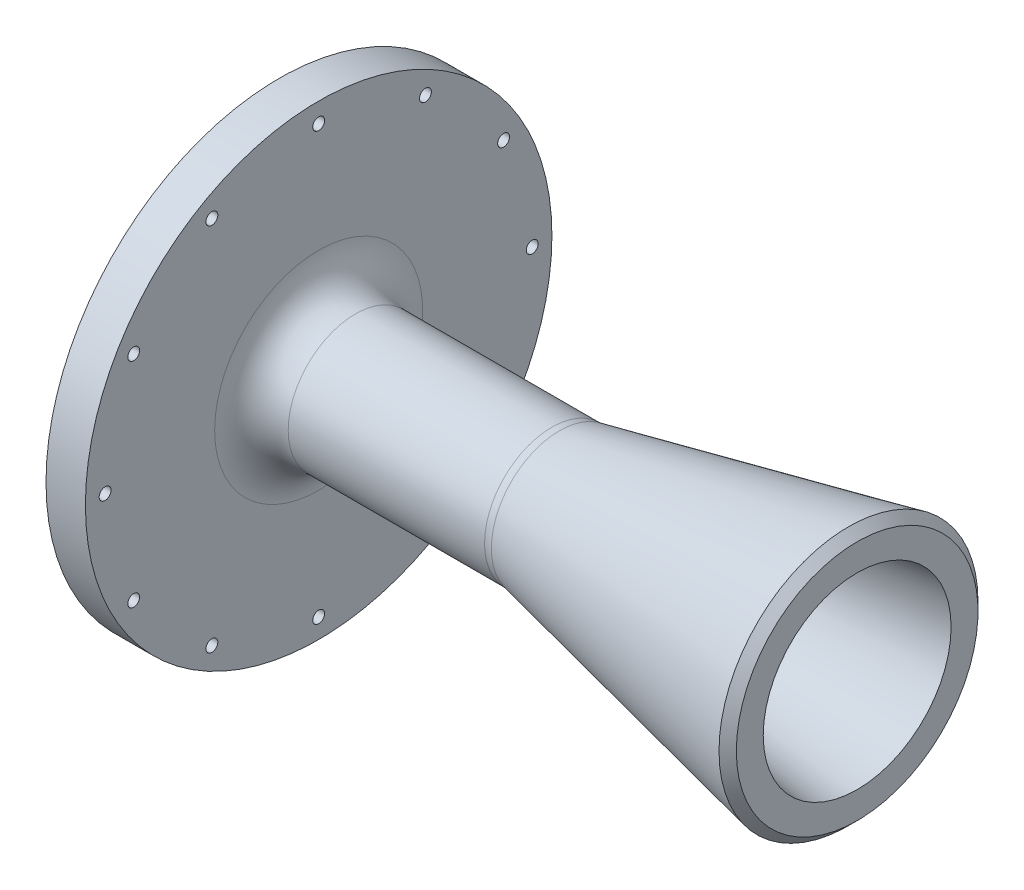
ISO-10303-21;
HEADER;
FILE_DESCRIPTION(('STEP AP214'),'2;1');
FILE_NAME('part.step','',(''),(''),'','','');
FILE_SCHEMA(('AUTOMOTIVE_DESIGN { 1 0 10303 214 1 1 1 1 }'));
ENDSEC;
DATA;
#1=APPLICATION_CONTEXT('core data for automotive mechanical design processes');
#2=APPLICATION_PROTOCOL_DEFINITION('international standard','automotive_design',2000,#1);
#3=PRODUCT_CONTEXT('',#1,'mechanical');
#4=PRODUCT('Part','Part','',(#3));
#5=PRODUCT_RELATED_PRODUCT_CATEGORY('part','',(#4));
#6=PRODUCT_DEFINITION_FORMATION('','',#4);
#7=PRODUCT_DEFINITION_CONTEXT('part definition',#1,'design');
#8=PRODUCT_DEFINITION('design','',#6,#7);
#9=PRODUCT_DEFINITION_SHAPE('','',#8);
#10=(LENGTH_UNIT() NAMED_UNIT(*) SI_UNIT(.MILLI.,.METRE.));
#11=(NAMED_UNIT(*) PLANE_ANGLE_UNIT() SI_UNIT($,.RADIAN.));
#12=(NAMED_UNIT(*) SI_UNIT($,.STERADIAN.) SOLID_ANGLE_UNIT());
#13=UNCERTAINTY_MEASURE_WITH_UNIT(LENGTH_MEASURE(1.E-05),#10,'distance_accuracy_value','');
#14=(GEOMETRIC_REPRESENTATION_CONTEXT(3) GLOBAL_UNCERTAINTY_ASSIGNED_CONTEXT((#13)) GLOBAL_UNIT_ASSIGNED_CONTEXT((#10,
#11,#12)) REPRESENTATION_CONTEXT('',''));
#15=CARTESIAN_POINT('',(0.,0.,0.));
#16=DIRECTION('',(0.,0.,1.));
#17=DIRECTION('',(1.,0.,0.));
#18=AXIS2_PLACEMENT_3D('',#15,#16,#17);
#19=CARTESIAN_POINT('',(0.,20.583496155902,0.));
#20=DIRECTION('',(1.,0.,0.));
#21=DIRECTION('',(0.,0.,-1.));
#22=AXIS2_PLACEMENT_3D('',#19,#20,#21);
#23=PLANE('',#22);
#24=CARTESIAN_POINT('',(0.,0.,0.));
#25=DIRECTION('',(1.,0.,0.));
#26=DIRECTION('',(0.,0.,-1.));
#27=AXIS2_PLACEMENT_3D('',#24,#25,#26);
#28=CIRCLE('',#27,38.1);
#29=CARTESIAN_POINT('',(0.,0.,-38.1));
#30=VERTEX_POINT('',#29);
#31=EDGE_CURVE('E190',#30,#30,#28,.T.);
#32=ORIENTED_EDGE('',*,*,#31,.T.);
#33=EDGE_LOOP('',(#32));
#34=FACE_BOUND('',#33,.T.);
#35=CARTESIAN_POINT('',(0.,-13.3616626129386,49.8664037450867));
#36=DIRECTION('',(-1.,0.,0.));
#37=DIRECTION('',(0.,0.,1.));
#38=AXIS2_PLACEMENT_3D('',#35,#36,#37);
#39=CIRCLE('',#38,2.38125);
#40=CARTESIAN_POINT('',(0.,-13.3616626129386,52.2476537450867));
#41=VERTEX_POINT('',#40);
#42=EDGE_CURVE('E75',#41,#41,#39,.T.);
#43=ORIENTED_EDGE('',*,*,#42,.F.);
#44=EDGE_LOOP('',(#43));
#45=FACE_BOUND('',#44,.T.);
#46=CARTESIAN_POINT('',(0.,13.3616626129382,-49.8664037450868));
#47=DIRECTION('',(-1.,0.,0.));
#48=DIRECTION('',(0.,0.,1.));
#49=AXIS2_PLACEMENT_3D('',#46,#47,#48);
#50=CIRCLE('',#49,2.38125);
#51=CARTESIAN_POINT('',(0.,13.3616626129382,-47.4851537450868));
#52=VERTEX_POINT('',#51);
#53=EDGE_CURVE('E74',#52,#52,#50,.T.);
#54=ORIENTED_EDGE('',*,*,#53,.F.);
#55=EDGE_LOOP('',(#54));
#56=FACE_BOUND('',#55,.T.);
#57=CARTESIAN_POINT('',(0.,51.6255,0.));
#58=DIRECTION('',(-1.,0.,0.));
#59=DIRECTION('',(0.,0.,1.));
#60=AXIS2_PLACEMENT_3D('',#57,#58,#59);
#61=CIRCLE('',#60,1.43509999999999);
#62=CARTESIAN_POINT('',(0.,51.6255,1.43509999999999));
#63=VERTEX_POINT('',#62);
#64=EDGE_CURVE('E123',#63,#63,#61,.T.);
#65=ORIENTED_EDGE('',*,*,#64,.F.);
#66=EDGE_LOOP('',(#65));
#67=FACE_BOUND('',#66,.T.);
#68=CARTESIAN_POINT('',(0.,44.7089944830736,25.81275));
#69=DIRECTION('',(-1.,0.,0.));
#70=DIRECTION('',(0.,0.,1.));
#71=AXIS2_PLACEMENT_3D('',#68,#69,#70);
#72=CIRCLE('',#71,1.43509999999999);
#73=CARTESIAN_POINT('',(0.,44.7089944830736,27.24785));
#74=VERTEX_POINT('',#73);
#75=EDGE_CURVE('E129',#74,#74,#72,.T.);
#76=ORIENTED_EDGE('',*,*,#75,.F.);
#77=EDGE_LOOP('',(#76));
#78=FACE_BOUND('',#77,.T.);
#79=CARTESIAN_POINT('',(0.,0.,51.6255));
#80=DIRECTION('',(-1.,0.,0.));
#81=DIRECTION('',(0.,0.,1.));
#82=AXIS2_PLACEMENT_3D('',#79,#80,#81);
#83=CIRCLE('',#82,1.43509999999999);
#84=CARTESIAN_POINT('',(0.,0.,53.0606));
#85=VERTEX_POINT('',#84);
#86=EDGE_CURVE('E141',#85,#85,#83,.T.);
#87=ORIENTED_EDGE('',*,*,#86,.F.);
#88=EDGE_LOOP('',(#87));
#89=FACE_BOUND('',#88,.T.);
#90=CARTESIAN_POINT('',(0.,-25.81275,44.7089944830736));
#91=DIRECTION('',(-1.,0.,0.));
#92=DIRECTION('',(0.,0.,1.));
#93=AXIS2_PLACEMENT_3D('',#90,#91,#92);
#94=CIRCLE('',#93,1.43509999999999);
#95=CARTESIAN_POINT('',(0.,-25.81275,46.1440944830736));
#96=VERTEX_POINT('',#95);
#97=EDGE_CURVE('E147',#96,#96,#94,.T.);
#98=ORIENTED_EDGE('',*,*,#97,.F.);
#99=EDGE_LOOP('',(#98));
#100=FACE_BOUND('',#99,.T.);
#101=CARTESIAN_POINT('',(0.,-44.7089944830735,25.81275));
#102=DIRECTION('',(-1.,0.,0.));
#103=DIRECTION('',(0.,0.,1.));
#104=AXIS2_PLACEMENT_3D('',#101,#102,#103);
#105=CIRCLE('',#104,1.43509999999999);
#106=CARTESIAN_POINT('',(0.,-44.7089944830735,27.24785));
#107=VERTEX_POINT('',#106);
#108=EDGE_CURVE('E153',#107,#107,#105,.T.);
#109=ORIENTED_EDGE('',*,*,#108,.F.);
#110=EDGE_LOOP('',(#109));
#111=FACE_BOUND('',#110,.T.);
#112=CARTESIAN_POINT('',(0.,0.,0.));
#113=DIRECTION('',(-1.,0.,0.));
#114=DIRECTION('',(0.,0.,1.));
#115=AXIS2_PLACEMENT_3D('',#112,#113,#114);
#116=CIRCLE('',#115,56.388);
#117=CARTESIAN_POINT('',(0.,0.,56.388));
#118=VERTEX_POINT('',#117);
#119=EDGE_CURVE('E165',#118,#118,#116,.T.);
#120=ORIENTED_EDGE('',*,*,#119,.T.);
#121=EDGE_LOOP('',(#120));
#122=FACE_BOUND('',#121,.T.);
#123=CARTESIAN_POINT('',(0.,25.81275,44.7089944830735));
#124=DIRECTION('',(-1.,0.,0.));
#125=DIRECTION('',(0.,0.,1.));
#126=AXIS2_PLACEMENT_3D('',#123,#124,#125);
#127=CIRCLE('',#126,1.43509999999999);
#128=CARTESIAN_POINT('',(0.,25.81275,46.1440944830735));
#129=VERTEX_POINT('',#128);
#130=EDGE_CURVE('E135',#129,#129,#127,.T.);
#131=ORIENTED_EDGE('',*,*,#130,.F.);
#132=EDGE_LOOP('',(#131));
#133=FACE_BOUND('',#132,.T.);
#134=CARTESIAN_POINT('',(0.,44.7089944830735,-25.81275));
#135=DIRECTION('',(-1.,0.,0.));
#136=DIRECTION('',(0.,0.,1.));
#137=AXIS2_PLACEMENT_3D('',#134,#135,#136);
#138=CIRCLE('',#137,1.43509999999999);
#139=CARTESIAN_POINT('',(0.,44.7089944830735,-24.37765));
#140=VERTEX_POINT('',#139);
#141=EDGE_CURVE('E117',#140,#140,#138,.T.);
#142=ORIENTED_EDGE('',*,*,#141,.F.);
#143=EDGE_LOOP('',(#142));
#144=FACE_BOUND('',#143,.T.);
#145=CARTESIAN_POINT('',(0.,25.81275,-44.7089944830735));
#146=DIRECTION('',(-1.,0.,0.));
#147=DIRECTION('',(0.,0.,1.));
#148=AXIS2_PLACEMENT_3D('',#145,#146,#147);
#149=CIRCLE('',#148,1.43509999999999);
#150=CARTESIAN_POINT('',(0.,25.81275,-43.2738944830736));
#151=VERTEX_POINT('',#150);
#152=EDGE_CURVE('E111',#151,#151,#149,.T.);
#153=ORIENTED_EDGE('',*,*,#152,.F.);
#154=EDGE_LOOP('',(#153));
#155=FACE_BOUND('',#154,.T.);
#156=CARTESIAN_POINT('',(0.,0.,-51.6255));
#157=DIRECTION('',(-1.,0.,0.));
#158=DIRECTION('',(0.,0.,1.));
#159=AXIS2_PLACEMENT_3D('',#156,#157,#158);
#160=CIRCLE('',#159,1.43509999999999);
#161=CARTESIAN_POINT('',(0.,0.,-50.1904));
#162=VERTEX_POINT('',#161);
#163=EDGE_CURVE('E105',#162,#162,#160,.T.);
#164=ORIENTED_EDGE('',*,*,#163,.F.);
#165=EDGE_LOOP('',(#164));
#166=FACE_BOUND('',#165,.T.);
#167=CARTESIAN_POINT('',(0.,-25.81275,-44.7089944830735));
#168=DIRECTION('',(-1.,0.,0.));
#169=DIRECTION('',(0.,0.,1.));
#170=AXIS2_PLACEMENT_3D('',#167,#168,#169);
#171=CIRCLE('',#170,1.43509999999999);
#172=CARTESIAN_POINT('',(0.,-25.81275,-43.2738944830735));
#173=VERTEX_POINT('',#172);
#174=EDGE_CURVE('E99',#173,#173,#171,.T.);
#175=ORIENTED_EDGE('',*,*,#174,.F.);
#176=EDGE_LOOP('',(#175));
#177=FACE_BOUND('',#176,.T.);
#178=CARTESIAN_POINT('',(0.,-44.7089944830735,-25.81275));
#179=DIRECTION('',(-1.,0.,0.));
#180=DIRECTION('',(0.,0.,1.));
#181=AXIS2_PLACEMENT_3D('',#178,#179,#180);
#182=CIRCLE('',#181,1.43509999999999);
#183=CARTESIAN_POINT('',(0.,-44.7089944830735,-24.37765));
#184=VERTEX_POINT('',#183);
#185=EDGE_CURVE('E93',#184,#184,#182,.T.);
#186=ORIENTED_EDGE('',*,*,#185,.F.);
#187=EDGE_LOOP('',(#186));
#188=FACE_BOUND('',#187,.T.);
#189=CARTESIAN_POINT('',(0.,-51.6255,0.));
#190=DIRECTION('',(-1.,0.,0.));
#191=DIRECTION('',(0.,0.,1.));
#192=AXIS2_PLACEMENT_3D('',#189,#190,#191);
#193=CIRCLE('',#192,1.43509999999999);
#194=CARTESIAN_POINT('',(0.,-51.6255,1.43509999999999));
#195=VERTEX_POINT('',#194);
#196=EDGE_CURVE('E87',#195,#195,#193,.T.);
#197=ORIENTED_EDGE('',*,*,#196,.F.);
#198=EDGE_LOOP('',(#197));
#199=FACE_BOUND('',#198,.T.);
#200=ADVANCED_FACE('F50',(#34,#45,#56,#67,#78,#89,#100,#111,#122,#133,#144,#155,#166,#177,#188,
#199),#23,.F.);
#201=CARTESIAN_POINT('',(60.325,0.,0.));
#202=DIRECTION('',(1.,0.,0.));
#203=DIRECTION('',(0.,0.,-1.));
#204=AXIS2_PLACEMENT_3D('',#201,#202,#203);
#205=CONICAL_SURFACE('',#204,12.7207818181818,0.125160507663512);
#206=CARTESIAN_POINT('',(139.7,0.,0.));
#207=DIRECTION('',(-1.,0.,0.));
#208=DIRECTION('',(0.,0.,1.));
#209=AXIS2_PLACEMENT_3D('',#206,#207,#208);
#210=CIRCLE('',#209,22.7076);
#211=CARTESIAN_POINT('',(139.7,0.,22.7076));
#212=VERTEX_POINT('',#211);
#213=EDGE_CURVE('E159',#212,#212,#210,.T.);
#214=ORIENTED_EDGE('',*,*,#213,.F.);
#215=EDGE_LOOP('',(#214));
#216=FACE_BOUND('',#215,.T.);
#217=CARTESIAN_POINT('',(60.325,0.,0.));
#218=DIRECTION('',(-1.,0.,0.));
#219=DIRECTION('',(0.,0.,1.));
#220=AXIS2_PLACEMENT_3D('',#217,#218,#219);
#221=CIRCLE('',#220,12.7207818181818);
#222=CARTESIAN_POINT('',(60.325,0.,12.7207818181818));
#223=VERTEX_POINT('',#222);
#224=EDGE_CURVE('E174',#223,#223,#221,.T.);
#225=ORIENTED_EDGE('',*,*,#224,.T.);
#226=EDGE_LOOP('',(#225));
#227=FACE_BOUND('',#226,.T.);
#228=ADVANCED_FACE('F208',(#216,#227),#205,.F.);
#229=CARTESIAN_POINT('',(60.325,12.7207818181818,0.));
#230=DIRECTION('',(1.,0.,0.));
#231=DIRECTION('',(0.,0.,-1.));
#232=AXIS2_PLACEMENT_3D('',#229,#230,#231);
#233=PLANE('',#232);
#234=ORIENTED_EDGE('',*,*,#224,.F.);
#235=EDGE_LOOP('',(#234));
#236=FACE_BOUND('',#235,.T.);
#237=CARTESIAN_POINT('',(60.325,0.,0.));
#238=DIRECTION('',(-1.,0.,0.));
#239=DIRECTION('',(0.,0.,1.));
#240=AXIS2_PLACEMENT_3D('',#237,#238,#239);
#241=CIRCLE('',#240,14.351);
#242=CARTESIAN_POINT('',(60.325,0.,14.351));
#243=VERTEX_POINT('',#242);
#244=EDGE_CURVE('E171',#243,#243,#241,.T.);
#245=ORIENTED_EDGE('',*,*,#244,.T.);
#246=EDGE_LOOP('',(#245));
#247=FACE_BOUND('',#246,.T.);
#248=ADVANCED_FACE('F214',(#236,#247),#233,.F.);
#249=CARTESIAN_POINT('',(0.,0.,0.));
#250=DIRECTION('',(-1.,0.,0.));
#251=DIRECTION('',(0.,0.,1.));
#252=AXIS2_PLACEMENT_3D('',#249,#250,#251);
#253=CYLINDRICAL_SURFACE('',#252,14.351);
#254=ORIENTED_EDGE('',*,*,#244,.F.);
#255=EDGE_LOOP('',(#254));
#256=FACE_BOUND('',#255,.T.);
#257=CARTESIAN_POINT('',(10.795,0.,0.));
#258=DIRECTION('',(-1.,0.,0.));
#259=DIRECTION('',(0.,0.,1.));
#260=AXIS2_PLACEMENT_3D('',#257,#258,#259);
#261=CIRCLE('',#260,14.351);
#262=CARTESIAN_POINT('',(10.795,0.,14.351));
#263=VERTEX_POINT('',#262);
#264=EDGE_CURVE('E168',#263,#263,#261,.T.);
#265=ORIENTED_EDGE('',*,*,#264,.T.);
#266=EDGE_LOOP('',(#265));
#267=FACE_BOUND('',#266,.T.);
#268=ADVANCED_FACE('F226',(#256,#267),#253,.F.);
#269=CARTESIAN_POINT('',(0.,0.,0.));
#270=DIRECTION('',(-1.,0.,0.));
#271=DIRECTION('',(0.,0.,1.));
#272=AXIS2_PLACEMENT_3D('',#269,#270,#271);
#273=CONICAL_SURFACE('',#272,20.583496155902,0.5235987755983);
#274=CARTESIAN_POINT('',(1.61402236879913,0.,0.));
#275=DIRECTION('',(-1.,0.,0.));
#276=DIRECTION('',(0.,0.,1.));
#277=AXIS2_PLACEMENT_3D('',#274,#275,#276);
#278=CIRCLE('',#277,19.6516399067978);
#279=CARTESIAN_POINT('',(1.61402236879913,0.,19.6516399067978));
#280=VERTEX_POINT('',#279);
#281=EDGE_CURVE('E81',#280,#280,#278,.T.);
#282=ORIENTED_EDGE('',*,*,#281,.T.);
#283=EDGE_LOOP('',(#282));
#284=FACE_BOUND('',#283,.T.);
#285=ORIENTED_EDGE('',*,*,#264,.F.);
#286=EDGE_LOOP('',(#285));
#287=FACE_BOUND('',#286,.T.);
#288=ADVANCED_FACE('F223',(#284,#287),#273,.F.);
#289=CARTESIAN_POINT('',(0.,0.,0.));
#290=DIRECTION('',(-1.,0.,0.));
#291=DIRECTION('',(0.,0.,1.));
#292=AXIS2_PLACEMENT_3D('',#289,#290,#291);
#293=CYLINDRICAL_SURFACE('',#292,56.388);
#294=ORIENTED_EDGE('',*,*,#119,.F.);
#295=EDGE_LOOP('',(#294));
#296=FACE_BOUND('',#295,.T.);
#297=CARTESIAN_POINT('',(9.525,0.,0.));
#298=DIRECTION('',(-1.,0.,0.));
#299=DIRECTION('',(0.,0.,1.));
#300=AXIS2_PLACEMENT_3D('',#297,#298,#299);
#301=CIRCLE('',#300,56.388);
#302=CARTESIAN_POINT('',(9.525,0.,56.388));
#303=VERTEX_POINT('',#302);
#304=EDGE_CURVE('E162',#303,#303,#301,.T.);
#305=ORIENTED_EDGE('',*,*,#304,.T.);
#306=EDGE_LOOP('',(#305));
#307=FACE_BOUND('',#306,.T.);
#308=ADVANCED_FACE('F221',(#296,#307),#293,.T.);
#309=CARTESIAN_POINT('',(9.525,56.388,0.));
#310=DIRECTION('',(-1.,0.,0.));
#311=DIRECTION('',(0.,0.,1.));
#312=AXIS2_PLACEMENT_3D('',#309,#310,#311);
#313=PLANE('',#312);
#314=CARTESIAN_POINT('',(9.525,0.,0.));
#315=DIRECTION('',(-1.,0.,0.));
#316=DIRECTION('',(0.,0.,1.));
#317=AXIS2_PLACEMENT_3D('',#314,#315,#316);
#318=CIRCLE('',#317,25.146);
#319=CARTESIAN_POINT('',(9.525,0.,25.146));
#320=VERTEX_POINT('',#319);
#321=EDGE_CURVE('E177',#320,#320,#318,.T.);
#322=ORIENTED_EDGE('',*,*,#321,.T.);
#323=EDGE_LOOP('',(#322));
#324=FACE_BOUND('',#323,.T.);
#325=CARTESIAN_POINT('',(9.525,-51.6255,0.));
#326=DIRECTION('',(-1.,0.,0.));
#327=DIRECTION('',(0.,0.,1.));
#328=AXIS2_PLACEMENT_3D('',#325,#326,#327);
#329=CIRCLE('',#328,1.43509999999999);
#330=CARTESIAN_POINT('',(9.525,-51.6255,1.43509999999999));
#331=VERTEX_POINT('',#330);
#332=EDGE_CURVE('E90',#331,#331,#329,.T.);
#333=ORIENTED_EDGE('',*,*,#332,.T.);
#334=EDGE_LOOP('',(#333));
#335=FACE_BOUND('',#334,.T.);
#336=CARTESIAN_POINT('',(9.525,-44.7089944830735,-25.81275));
#337=DIRECTION('',(-1.,0.,0.));
#338=DIRECTION('',(0.,0.,1.));
#339=AXIS2_PLACEMENT_3D('',#336,#337,#338);
#340=CIRCLE('',#339,1.43509999999999);
#341=CARTESIAN_POINT('',(9.525,-44.7089944830735,-24.37765));
#342=VERTEX_POINT('',#341);
#343=EDGE_CURVE('E96',#342,#342,#340,.T.);
#344=ORIENTED_EDGE('',*,*,#343,.T.);
#345=EDGE_LOOP('',(#344));
#346=FACE_BOUND('',#345,.T.);
#347=CARTESIAN_POINT('',(9.525,-25.81275,-44.7089944830735));
#348=DIRECTION('',(-1.,0.,0.));
#349=DIRECTION('',(0.,0.,1.));
#350=AXIS2_PLACEMENT_3D('',#347,#348,#349);
#351=CIRCLE('',#350,1.43509999999999);
#352=CARTESIAN_POINT('',(9.525,-25.81275,-43.2738944830735));
#353=VERTEX_POINT('',#352);
#354=EDGE_CURVE('E102',#353,#353,#351,.T.);
#355=ORIENTED_EDGE('',*,*,#354,.T.);
#356=EDGE_LOOP('',(#355));
#357=FACE_BOUND('',#356,.T.);
#358=CARTESIAN_POINT('',(9.525,0.,-51.6255));
#359=DIRECTION('',(-1.,0.,0.));
#360=DIRECTION('',(0.,0.,1.));
#361=AXIS2_PLACEMENT_3D('',#358,#359,#360);
#362=CIRCLE('',#361,1.43509999999999);
#363=CARTESIAN_POINT('',(9.525,0.,-50.1904));
#364=VERTEX_POINT('',#363);
#365=EDGE_CURVE('E108',#364,#364,#362,.T.);
#366=ORIENTED_EDGE('',*,*,#365,.T.);
#367=EDGE_LOOP('',(#366));
#368=FACE_BOUND('',#367,.T.);
#369=CARTESIAN_POINT('',(9.525,25.81275,-44.7089944830735));
#370=DIRECTION('',(-1.,0.,0.));
#371=DIRECTION('',(0.,0.,1.));
#372=AXIS2_PLACEMENT_3D('',#369,#370,#371);
#373=CIRCLE('',#372,1.43509999999999);
#374=CARTESIAN_POINT('',(9.525,25.81275,-43.2738944830736));
#375=VERTEX_POINT('',#374);
#376=EDGE_CURVE('E114',#375,#375,#373,.T.);
#377=ORIENTED_EDGE('',*,*,#376,.T.);
#378=EDGE_LOOP('',(#377));
#379=FACE_BOUND('',#378,.T.);
#380=CARTESIAN_POINT('',(9.525,44.7089944830735,-25.81275));
#381=DIRECTION('',(-1.,0.,0.));
#382=DIRECTION('',(0.,0.,1.));
#383=AXIS2_PLACEMENT_3D('',#380,#381,#382);
#384=CIRCLE('',#383,1.43509999999999);
#385=CARTESIAN_POINT('',(9.525,44.7089944830735,-24.37765));
#386=VERTEX_POINT('',#385);
#387=EDGE_CURVE('E120',#386,#386,#384,.T.);
#388=ORIENTED_EDGE('',*,*,#387,.T.);
#389=EDGE_LOOP('',(#388));
#390=FACE_BOUND('',#389,.T.);
#391=CARTESIAN_POINT('',(9.525,51.6255,0.));
#392=DIRECTION('',(-1.,0.,0.));
#393=DIRECTION('',(0.,0.,1.));
#394=AXIS2_PLACEMENT_3D('',#391,#392,#393);
#395=CIRCLE('',#394,1.43509999999999);
#396=CARTESIAN_POINT('',(9.525,51.6255,1.43509999999999));
#397=VERTEX_POINT('',#396);
#398=EDGE_CURVE('E126',#397,#397,#395,.T.);
#399=ORIENTED_EDGE('',*,*,#398,.T.);
#400=EDGE_LOOP('',(#399));
#401=FACE_BOUND('',#400,.T.);
#402=CARTESIAN_POINT('',(9.525,44.7089944830736,25.81275));
#403=DIRECTION('',(-1.,0.,0.));
#404=DIRECTION('',(0.,0.,1.));
#405=AXIS2_PLACEMENT_3D('',#402,#403,#404);
#406=CIRCLE('',#405,1.43509999999999);
#407=CARTESIAN_POINT('',(9.525,44.7089944830736,27.24785));
#408=VERTEX_POINT('',#407);
#409=EDGE_CURVE('E132',#408,#408,#406,.T.);
#410=ORIENTED_EDGE('',*,*,#409,.T.);
#411=EDGE_LOOP('',(#410));
#412=FACE_BOUND('',#411,.T.);
#413=CARTESIAN_POINT('',(9.525,25.81275,44.7089944830735));
#414=DIRECTION('',(-1.,0.,0.));
#415=DIRECTION('',(0.,0.,1.));
#416=AXIS2_PLACEMENT_3D('',#413,#414,#415);
#417=CIRCLE('',#416,1.43509999999999);
#418=CARTESIAN_POINT('',(9.525,25.81275,46.1440944830735));
#419=VERTEX_POINT('',#418);
#420=EDGE_CURVE('E138',#419,#419,#417,.T.);
#421=ORIENTED_EDGE('',*,*,#420,.T.);
#422=EDGE_LOOP('',(#421));
#423=FACE_BOUND('',#422,.T.);
#424=CARTESIAN_POINT('',(9.525,0.,51.6255));
#425=DIRECTION('',(-1.,0.,0.));
#426=DIRECTION('',(0.,0.,1.));
#427=AXIS2_PLACEMENT_3D('',#424,#425,#426);
#428=CIRCLE('',#427,1.43509999999999);
#429=CARTESIAN_POINT('',(9.525,0.,53.0606));
#430=VERTEX_POINT('',#429);
#431=EDGE_CURVE('E144',#430,#430,#428,.T.);
#432=ORIENTED_EDGE('',*,*,#431,.T.);
#433=EDGE_LOOP('',(#432));
#434=FACE_BOUND('',#433,.T.);
#435=CARTESIAN_POINT('',(9.525,-25.81275,44.7089944830736));
#436=DIRECTION('',(-1.,0.,0.));
#437=DIRECTION('',(0.,0.,1.));
#438=AXIS2_PLACEMENT_3D('',#435,#436,#437);
#439=CIRCLE('',#438,1.43509999999999);
#440=CARTESIAN_POINT('',(9.525,-25.81275,46.1440944830736));
#441=VERTEX_POINT('',#440);
#442=EDGE_CURVE('E150',#441,#441,#439,.T.);
#443=ORIENTED_EDGE('',*,*,#442,.T.);
#444=EDGE_LOOP('',(#443));
#445=FACE_BOUND('',#444,.T.);
#446=CARTESIAN_POINT('',(9.525,-44.7089944830735,25.81275));
#447=DIRECTION('',(-1.,0.,0.));
#448=DIRECTION('',(0.,0.,1.));
#449=AXIS2_PLACEMENT_3D('',#446,#447,#448);
#450=CIRCLE('',#449,1.43509999999999);
#451=CARTESIAN_POINT('',(9.525,-44.7089944830735,27.24785));
#452=VERTEX_POINT('',#451);
#453=EDGE_CURVE('E156',#452,#452,#450,.T.);
#454=ORIENTED_EDGE('',*,*,#453,.T.);
#455=EDGE_LOOP('',(#454));
#456=FACE_BOUND('',#455,.T.);
#457=ORIENTED_EDGE('',*,*,#304,.F.);
#458=EDGE_LOOP('',(#457));
#459=FACE_BOUND('',#458,.T.);
#460=ADVANCED_FACE('F247',(#324,#335,#346,#357,#368,#379,#390,#401,#412,#423,#434,#445,#456,
#459),#313,.F.);
#461=CARTESIAN_POINT('',(0.,0.,0.));
#462=DIRECTION('',(-1.,0.,0.));
#463=DIRECTION('',(0.,0.,1.));
#464=AXIS2_PLACEMENT_3D('',#461,#462,#463);
#465=CYLINDRICAL_SURFACE('',#464,16.256);
#466=CARTESIAN_POINT('',(18.415,0.,0.));
#467=DIRECTION('',(-1.,0.,0.));
#468=DIRECTION('',(0.,0.,1.));
#469=AXIS2_PLACEMENT_3D('',#466,#467,#468);
#470=CIRCLE('',#469,16.256);
#471=CARTESIAN_POINT('',(18.415,0.,16.256));
#472=VERTEX_POINT('',#471);
#473=EDGE_CURVE('E183',#472,#472,#470,.F.);
#474=ORIENTED_EDGE('',*,*,#473,.T.);
#475=EDGE_LOOP('',(#474));
#476=FACE_BOUND('',#475,.T.);
#477=CARTESIAN_POINT('',(65.8720844322291,0.,0.));
#478=DIRECTION('',(-1.,0.,0.));
#479=DIRECTION('',(0.,0.,1.));
#480=AXIS2_PLACEMENT_3D('',#477,#478,#479);
#481=CIRCLE('',#480,16.256);
#482=CARTESIAN_POINT('',(65.8720844322291,0.,16.256));
#483=VERTEX_POINT('',#482);
#484=EDGE_CURVE('E180',#483,#483,#481,.T.);
#485=ORIENTED_EDGE('',*,*,#484,.T.);
#486=EDGE_LOOP('',(#485));
#487=FACE_BOUND('',#486,.T.);
#488=ADVANCED_FACE('F245',(#476,#487),#465,.T.);
#489=CARTESIAN_POINT('',(139.7,0.,0.));
#490=DIRECTION('',(1.,0.,0.));
#491=DIRECTION('',(0.,0.,-1.));
#492=AXIS2_PLACEMENT_3D('',#489,#490,#491);
#493=CONICAL_SURFACE('',#492,31.75,0.20943951023932);
#494=CARTESIAN_POINT('',(137.605252356639,0.,0.));
#495=DIRECTION('',(-1.,0.,0.));
#496=DIRECTION('',(0.,0.,1.));
#497=AXIS2_PLACEMENT_3D('',#494,#495,#496);
#498=CIRCLE('',#497,31.3047476433608);
#499=CARTESIAN_POINT('',(137.605252356639,0.,31.3047476433608));
#500=VERTEX_POINT('',#499);
#501=EDGE_CURVE('E58',#500,#500,#498,.T.);
#502=ORIENTED_EDGE('',*,*,#501,.T.);
#503=EDGE_LOOP('',(#502));
#504=FACE_BOUND('',#503,.T.);
#505=CARTESIAN_POINT('',(67.720419363599,0.,0.));
#506=DIRECTION('',(1.,0.,0.));
#507=DIRECTION('',(0.,0.,-1.));
#508=AXIS2_PLACEMENT_3D('',#505,#506,#507);
#509=CIRCLE('',#508,16.4502678294765);
#510=CARTESIAN_POINT('',(67.720419363599,0.,-16.4502678294765));
#511=VERTEX_POINT('',#510);
#512=EDGE_CURVE('E186',#511,#511,#509,.T.);
#513=ORIENTED_EDGE('',*,*,#512,.T.);
#514=EDGE_LOOP('',(#513));
#515=FACE_BOUND('',#514,.T.);
#516=ADVANCED_FACE('F194',(#504,#515),#493,.T.);
#517=CARTESIAN_POINT('',(139.7,31.75,0.));
#518=DIRECTION('',(-1.,0.,0.));
#519=DIRECTION('',(0.,0.,1.));
#520=AXIS2_PLACEMENT_3D('',#517,#518,#519);
#521=PLANE('',#520);
#522=CARTESIAN_POINT('',(139.7,0.,0.));
#523=DIRECTION('',(-1.,0.,0.));
#524=DIRECTION('',(0.,0.,1.));
#525=AXIS2_PLACEMENT_3D('',#522,#523,#524);
#526=CIRCLE('',#525,29.21);
#527=CARTESIAN_POINT('',(139.7,0.,29.21));
#528=VERTEX_POINT('',#527);
#529=EDGE_CURVE('E13',#528,#528,#526,.F.);
#530=ORIENTED_EDGE('',*,*,#529,.T.);
#531=EDGE_LOOP('',(#530));
#532=FACE_BOUND('',#531,.T.);
#533=ORIENTED_EDGE('',*,*,#213,.T.);
#534=EDGE_LOOP('',(#533));
#535=FACE_BOUND('',#534,.T.);
#536=ADVANCED_FACE('F254',(#532,#535),#521,.F.);
#537=CARTESIAN_POINT('',(0.,-44.7089944830735,25.81275));
#538=DIRECTION('',(-1.,0.,0.));
#539=DIRECTION('',(0.,0.,1.));
#540=AXIS2_PLACEMENT_3D('',#537,#538,#539);
#541=CYLINDRICAL_SURFACE('',#540,1.43509999999999);
#542=ORIENTED_EDGE('',*,*,#453,.F.);
#543=EDGE_LOOP('',(#542));
#544=FACE_BOUND('',#543,.T.);
#545=ORIENTED_EDGE('',*,*,#108,.T.);
#546=EDGE_LOOP('',(#545));
#547=FACE_BOUND('',#546,.T.);
#548=ADVANCED_FACE('F260',(#544,#547),#541,.F.);
#549=CARTESIAN_POINT('',(0.,-25.81275,44.7089944830736));
#550=DIRECTION('',(-1.,0.,0.));
#551=DIRECTION('',(0.,0.,1.));
#552=AXIS2_PLACEMENT_3D('',#549,#550,#551);
#553=CYLINDRICAL_SURFACE('',#552,1.43509999999999);
#554=ORIENTED_EDGE('',*,*,#442,.F.);
#555=EDGE_LOOP('',(#554));
#556=FACE_BOUND('',#555,.T.);
#557=ORIENTED_EDGE('',*,*,#97,.T.);
#558=EDGE_LOOP('',(#557));
#559=FACE_BOUND('',#558,.T.);
#560=ADVANCED_FACE('F264',(#556,#559),#553,.F.);
#561=CARTESIAN_POINT('',(0.,0.,51.6255));
#562=DIRECTION('',(-1.,0.,0.));
#563=DIRECTION('',(0.,0.,1.));
#564=AXIS2_PLACEMENT_3D('',#561,#562,#563);
#565=CYLINDRICAL_SURFACE('',#564,1.43509999999999);
#566=ORIENTED_EDGE('',*,*,#431,.F.);
#567=EDGE_LOOP('',(#566));
#568=FACE_BOUND('',#567,.T.);
#569=ORIENTED_EDGE('',*,*,#86,.T.);
#570=EDGE_LOOP('',(#569));
#571=FACE_BOUND('',#570,.T.);
#572=ADVANCED_FACE('F268',(#568,#571),#565,.F.);
#573=CARTESIAN_POINT('',(0.,25.81275,44.7089944830735));
#574=DIRECTION('',(-1.,0.,0.));
#575=DIRECTION('',(0.,0.,1.));
#576=AXIS2_PLACEMENT_3D('',#573,#574,#575);
#577=CYLINDRICAL_SURFACE('',#576,1.43509999999999);
#578=ORIENTED_EDGE('',*,*,#420,.F.);
#579=EDGE_LOOP('',(#578));
#580=FACE_BOUND('',#579,.T.);
#581=ORIENTED_EDGE('',*,*,#130,.T.);
#582=EDGE_LOOP('',(#581));
#583=FACE_BOUND('',#582,.T.);
#584=ADVANCED_FACE('F272',(#580,#583),#577,.F.);
#585=CARTESIAN_POINT('',(0.,44.7089944830736,25.81275));
#586=DIRECTION('',(-1.,0.,0.));
#587=DIRECTION('',(0.,0.,1.));
#588=AXIS2_PLACEMENT_3D('',#585,#586,#587);
#589=CYLINDRICAL_SURFACE('',#588,1.43509999999999);
#590=ORIENTED_EDGE('',*,*,#409,.F.);
#591=EDGE_LOOP('',(#590));
#592=FACE_BOUND('',#591,.T.);
#593=ORIENTED_EDGE('',*,*,#75,.T.);
#594=EDGE_LOOP('',(#593));
#595=FACE_BOUND('',#594,.T.);
#596=ADVANCED_FACE('F276',(#592,#595),#589,.F.);
#597=CARTESIAN_POINT('',(0.,51.6255,0.));
#598=DIRECTION('',(-1.,0.,0.));
#599=DIRECTION('',(0.,0.,1.));
#600=AXIS2_PLACEMENT_3D('',#597,#598,#599);
#601=CYLINDRICAL_SURFACE('',#600,1.43509999999999);
#602=ORIENTED_EDGE('',*,*,#398,.F.);
#603=EDGE_LOOP('',(#602));
#604=FACE_BOUND('',#603,.T.);
#605=ORIENTED_EDGE('',*,*,#64,.T.);
#606=EDGE_LOOP('',(#605));
#607=FACE_BOUND('',#606,.T.);
#608=ADVANCED_FACE('F280',(#604,#607),#601,.F.);
#609=CARTESIAN_POINT('',(0.,44.7089944830735,-25.81275));
#610=DIRECTION('',(-1.,0.,0.));
#611=DIRECTION('',(0.,0.,1.));
#612=AXIS2_PLACEMENT_3D('',#609,#610,#611);
#613=CYLINDRICAL_SURFACE('',#612,1.43509999999999);
#614=ORIENTED_EDGE('',*,*,#387,.F.);
#615=EDGE_LOOP('',(#614));
#616=FACE_BOUND('',#615,.T.);
#617=ORIENTED_EDGE('',*,*,#141,.T.);
#618=EDGE_LOOP('',(#617));
#619=FACE_BOUND('',#618,.T.);
#620=ADVANCED_FACE('F284',(#616,#619),#613,.F.);
#621=CARTESIAN_POINT('',(0.,25.81275,-44.7089944830735));
#622=DIRECTION('',(-1.,0.,0.));
#623=DIRECTION('',(0.,0.,1.));
#624=AXIS2_PLACEMENT_3D('',#621,#622,#623);
#625=CYLINDRICAL_SURFACE('',#624,1.43509999999999);
#626=ORIENTED_EDGE('',*,*,#376,.F.);
#627=EDGE_LOOP('',(#626));
#628=FACE_BOUND('',#627,.T.);
#629=ORIENTED_EDGE('',*,*,#152,.T.);
#630=EDGE_LOOP('',(#629));
#631=FACE_BOUND('',#630,.T.);
#632=ADVANCED_FACE('F288',(#628,#631),#625,.F.);
#633=CARTESIAN_POINT('',(0.,0.,-51.6255));
#634=DIRECTION('',(-1.,0.,0.));
#635=DIRECTION('',(0.,0.,1.));
#636=AXIS2_PLACEMENT_3D('',#633,#634,#635);
#637=CYLINDRICAL_SURFACE('',#636,1.43509999999999);
#638=ORIENTED_EDGE('',*,*,#365,.F.);
#639=EDGE_LOOP('',(#638));
#640=FACE_BOUND('',#639,.T.);
#641=ORIENTED_EDGE('',*,*,#163,.T.);
#642=EDGE_LOOP('',(#641));
#643=FACE_BOUND('',#642,.T.);
#644=ADVANCED_FACE('F292',(#640,#643),#637,.F.);
#645=CARTESIAN_POINT('',(0.,-25.81275,-44.7089944830735));
#646=DIRECTION('',(-1.,0.,0.));
#647=DIRECTION('',(0.,0.,1.));
#648=AXIS2_PLACEMENT_3D('',#645,#646,#647);
#649=CYLINDRICAL_SURFACE('',#648,1.43509999999999);
#650=ORIENTED_EDGE('',*,*,#354,.F.);
#651=EDGE_LOOP('',(#650));
#652=FACE_BOUND('',#651,.T.);
#653=ORIENTED_EDGE('',*,*,#174,.T.);
#654=EDGE_LOOP('',(#653));
#655=FACE_BOUND('',#654,.T.);
#656=ADVANCED_FACE('F296',(#652,#655),#649,.F.);
#657=CARTESIAN_POINT('',(0.,-44.7089944830735,-25.81275));
#658=DIRECTION('',(-1.,0.,0.));
#659=DIRECTION('',(0.,0.,1.));
#660=AXIS2_PLACEMENT_3D('',#657,#658,#659);
#661=CYLINDRICAL_SURFACE('',#660,1.43509999999999);
#662=ORIENTED_EDGE('',*,*,#343,.F.);
#663=EDGE_LOOP('',(#662));
#664=FACE_BOUND('',#663,.T.);
#665=ORIENTED_EDGE('',*,*,#185,.T.);
#666=EDGE_LOOP('',(#665));
#667=FACE_BOUND('',#666,.T.);
#668=ADVANCED_FACE('F300',(#664,#667),#661,.F.);
#669=CARTESIAN_POINT('',(0.,-51.6255,0.));
#670=DIRECTION('',(-1.,0.,0.));
#671=DIRECTION('',(0.,0.,1.));
#672=AXIS2_PLACEMENT_3D('',#669,#670,#671);
#673=CYLINDRICAL_SURFACE('',#672,1.43509999999999);
#674=ORIENTED_EDGE('',*,*,#332,.F.);
#675=EDGE_LOOP('',(#674));
#676=FACE_BOUND('',#675,.T.);
#677=ORIENTED_EDGE('',*,*,#196,.T.);
#678=EDGE_LOOP('',(#677));
#679=FACE_BOUND('',#678,.T.);
#680=ADVANCED_FACE('F304',(#676,#679),#673,.F.);
#681=CARTESIAN_POINT('',(6.35,13.3616626129382,-49.8664037450868));
#682=DIRECTION('',(-1.,0.,0.));
#683=DIRECTION('',(0.,0.,1.));
#684=AXIS2_PLACEMENT_3D('',#681,#682,#683);
#685=CONICAL_SURFACE('',#684,2.38124999999999,1.02974425867665);
#686=CARTESIAN_POINT('',(7.78079934905938,13.3616626129382,-49.8664037450868));
#687=VERTEX_POINT('',#686);
#688=VERTEX_LOOP('',#687);
#689=FACE_BOUND('',#688,.T.);
#690=CARTESIAN_POINT('',(6.35,13.3616626129382,-49.8664037450868));
#691=DIRECTION('',(-1.,0.,0.));
#692=DIRECTION('',(0.,0.,1.));
#693=AXIS2_PLACEMENT_3D('',#690,#691,#692);
#694=CIRCLE('',#693,2.38124999999999);
#695=CARTESIAN_POINT('',(6.35,13.3616626129382,-47.4851537450868));
#696=VERTEX_POINT('',#695);
#697=EDGE_CURVE('E78',#696,#696,#694,.T.);
#698=ORIENTED_EDGE('',*,*,#697,.T.);
#699=EDGE_LOOP('',(#698));
#700=FACE_BOUND('',#699,.T.);
#701=ADVANCED_FACE('F308',(#689,#700),#685,.F.);
#702=CARTESIAN_POINT('',(0.,13.3616626129382,-49.8664037450868));
#703=DIRECTION('',(-1.,0.,0.));
#704=DIRECTION('',(0.,0.,1.));
#705=AXIS2_PLACEMENT_3D('',#702,#703,#704);
#706=CYLINDRICAL_SURFACE('',#705,2.38125);
#707=ORIENTED_EDGE('',*,*,#697,.F.);
#708=EDGE_LOOP('',(#707));
#709=FACE_BOUND('',#708,.T.);
#710=ORIENTED_EDGE('',*,*,#53,.T.);
#711=EDGE_LOOP('',(#710));
#712=FACE_BOUND('',#711,.T.);
#713=ADVANCED_FACE('F68',(#709,#712),#706,.F.);
#714=CARTESIAN_POINT('',(6.35,-13.3616626129386,49.8664037450867));
#715=DIRECTION('',(-1.,0.,0.));
#716=DIRECTION('',(0.,0.,1.));
#717=AXIS2_PLACEMENT_3D('',#714,#715,#716);
#718=CONICAL_SURFACE('',#717,2.38125,1.02974425867665);
#719=CARTESIAN_POINT('',(7.78079934905938,-13.3616626129386,49.8664037450867));
#720=VERTEX_POINT('',#719);
#721=VERTEX_LOOP('',#720);
#722=FACE_BOUND('',#721,.T.);
#723=CARTESIAN_POINT('',(6.35,-13.3616626129386,49.8664037450867));
#724=DIRECTION('',(-1.,0.,0.));
#725=DIRECTION('',(0.,0.,1.));
#726=AXIS2_PLACEMENT_3D('',#723,#724,#725);
#727=CIRCLE('',#726,2.38125);
#728=CARTESIAN_POINT('',(6.35,-13.3616626129386,52.2476537450867));
#729=VERTEX_POINT('',#728);
#730=EDGE_CURVE('E72',#729,#729,#727,.T.);
#731=ORIENTED_EDGE('',*,*,#730,.T.);
#732=EDGE_LOOP('',(#731));
#733=FACE_BOUND('',#732,.T.);
#734=ADVANCED_FACE('F64',(#722,#733),#718,.F.);
#735=CARTESIAN_POINT('',(0.,-13.3616626129386,49.8664037450867));
#736=DIRECTION('',(-1.,0.,0.));
#737=DIRECTION('',(0.,0.,1.));
#738=AXIS2_PLACEMENT_3D('',#735,#736,#737);
#739=CYLINDRICAL_SURFACE('',#738,2.38125);
#740=ORIENTED_EDGE('',*,*,#730,.F.);
#741=EDGE_LOOP('',(#740));
#742=FACE_BOUND('',#741,.T.);
#743=ORIENTED_EDGE('',*,*,#42,.T.);
#744=EDGE_LOOP('',(#743));
#745=FACE_BOUND('',#744,.T.);
#746=ADVANCED_FACE('F67',(#742,#745),#739,.F.);
#747=CARTESIAN_POINT('',(18.415,0.,0.));
#748=DIRECTION('',(-1.,0.,0.));
#749=DIRECTION('',(0.,0.,1.));
#750=AXIS2_PLACEMENT_3D('',#747,#748,#749);
#751=TOROIDAL_SURFACE('',#750,25.146,8.89);
#752=ORIENTED_EDGE('',*,*,#473,.F.);
#753=EDGE_LOOP('',(#752));
#754=FACE_BOUND('',#753,.T.);
#755=ORIENTED_EDGE('',*,*,#321,.F.);
#756=EDGE_LOOP('',(#755));
#757=FACE_BOUND('',#756,.T.);
#758=ADVANCED_FACE('F234',(#754,#757),#751,.F.);
#759=CARTESIAN_POINT('',(65.8720844322291,0.,0.));
#760=DIRECTION('',(-1.,0.,0.));
#761=DIRECTION('',(0.,0.,1.));
#762=AXIS2_PLACEMENT_3D('',#759,#760,#761);
#763=TOROIDAL_SURFACE('',#762,25.146,8.89);
#764=ORIENTED_EDGE('',*,*,#512,.F.);
#765=EDGE_LOOP('',(#764));
#766=FACE_BOUND('',#765,.T.);
#767=ORIENTED_EDGE('',*,*,#484,.F.);
#768=EDGE_LOOP('',(#767));
#769=FACE_BOUND('',#768,.T.);
#770=ADVANCED_FACE('F203',(#766,#769),#763,.F.);
#771=CARTESIAN_POINT('',(3.33331808033745,0.,0.));
#772=DIRECTION('',(-1.,0.,0.));
#773=DIRECTION('',(0.,0.,1.));
#774=AXIS2_PLACEMENT_3D('',#771,#772,#773);
#775=CONICAL_SURFACE('',#774,0.,1.48352986419519);
#776=ORIENTED_EDGE('',*,*,#31,.F.);
#777=EDGE_LOOP('',(#776));
#778=FACE_BOUND('',#777,.T.);
#779=ORIENTED_EDGE('',*,*,#281,.F.);
#780=EDGE_LOOP('',(#779));
#781=FACE_BOUND('',#780,.T.);
#782=ADVANCED_FACE('F198',(#778,#781),#775,.F.);
#783=CARTESIAN_POINT('',(137.605252356639,0.,0.));
#784=DIRECTION('',(-1.,0.,0.));
#785=DIRECTION('',(0.,0.,1.));
#786=AXIS2_PLACEMENT_3D('',#783,#784,#785);
#787=CONICAL_SURFACE('',#786,31.3047476433608,0.785398163397447);
#788=ORIENTED_EDGE('',*,*,#529,.F.);
#789=EDGE_LOOP('',(#788));
#790=FACE_BOUND('',#789,.T.);
#791=ORIENTED_EDGE('',*,*,#501,.F.);
#792=EDGE_LOOP('',(#791));
#793=FACE_BOUND('',#792,.T.);
#794=ADVANCED_FACE('F52',(#790,#793),#787,.T.);
#795=CLOSED_SHELL('',(#200,#228,#248,#268,#288,#308,#460,#488,#516,#536,#548,#560,#572,#584,
#596,#608,#620,#632,#644,#656,#668,#680,#701,#713,#734,#746,#758,#770,#782,#794));
#796=MANIFOLD_SOLID_BREP('B2',#795);
#797=ADVANCED_BREP_SHAPE_REPRESENTATION('',(#18,#796),#14);
#798=SHAPE_DEFINITION_REPRESENTATION(#9,#797);
ENDSEC;
END-ISO-10303-21;
